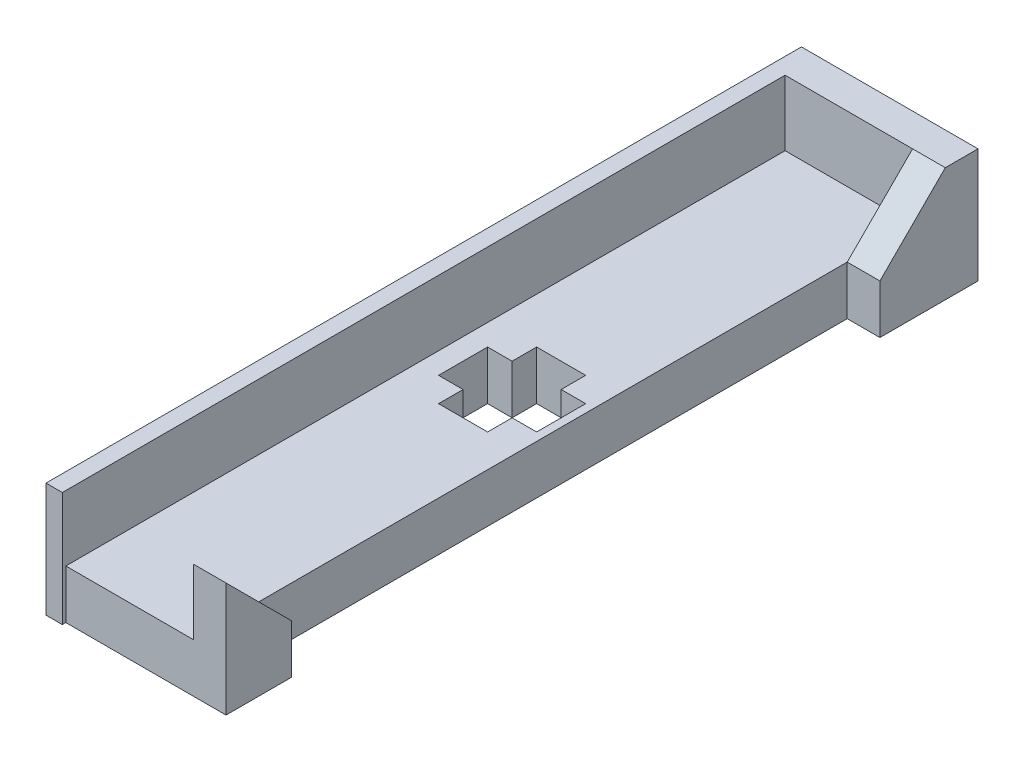
ISO-10303-21;
HEADER;
FILE_DESCRIPTION(('STEP AP214'),'2;1');
FILE_NAME('part.step','',(''),(''),'','','');
FILE_SCHEMA(('AUTOMOTIVE_DESIGN { 1 0 10303 214 1 1 1 1 }'));
ENDSEC;
DATA;
#1=APPLICATION_CONTEXT('core data for automotive mechanical design processes');
#2=APPLICATION_PROTOCOL_DEFINITION('international standard','automotive_design',2000,#1);
#3=PRODUCT_CONTEXT('',#1,'mechanical');
#4=PRODUCT('Part','Part','',(#3));
#5=PRODUCT_RELATED_PRODUCT_CATEGORY('part','',(#4));
#6=PRODUCT_DEFINITION_FORMATION('','',#4);
#7=PRODUCT_DEFINITION_CONTEXT('part definition',#1,'design');
#8=PRODUCT_DEFINITION('design','',#6,#7);
#9=PRODUCT_DEFINITION_SHAPE('','',#8);
#10=(LENGTH_UNIT() NAMED_UNIT(*) SI_UNIT(.MILLI.,.METRE.));
#11=(NAMED_UNIT(*) PLANE_ANGLE_UNIT() SI_UNIT($,.RADIAN.));
#12=(NAMED_UNIT(*) SI_UNIT($,.STERADIAN.) SOLID_ANGLE_UNIT());
#13=UNCERTAINTY_MEASURE_WITH_UNIT(LENGTH_MEASURE(1.E-05),#10,'distance_accuracy_value','');
#14=(GEOMETRIC_REPRESENTATION_CONTEXT(3) GLOBAL_UNCERTAINTY_ASSIGNED_CONTEXT((#13)) GLOBAL_UNIT_ASSIGNED_CONTEXT((#10,
#11,#12)) REPRESENTATION_CONTEXT('',''));
#15=CARTESIAN_POINT('',(0.,0.,0.));
#16=DIRECTION('',(0.,0.,1.));
#17=DIRECTION('',(1.,0.,0.));
#18=AXIS2_PLACEMENT_3D('',#15,#16,#17);
#19=CARTESIAN_POINT('',(-8.71823555429203,3.,-20.));
#20=DIRECTION('',(-1.,0.,0.));
#21=DIRECTION('',(0.,0.,1.));
#22=AXIS2_PLACEMENT_3D('',#19,#20,#21);
#23=PLANE('',#22);
#24=DIRECTION('',(0.,0.,-1.));
#25=VECTOR('',#24,1.);
#26=CARTESIAN_POINT('',(-8.71823555429203,0.,-20.));
#27=LINE('',#26,#25);
#28=CARTESIAN_POINT('',(-8.71823555429203,0.,-20.));
#29=VERTEX_POINT('',#28);
#30=CARTESIAN_POINT('',(-8.71823555429203,0.,-21.5));
#31=VERTEX_POINT('',#30);
#32=EDGE_CURVE('E268',#29,#31,#27,.T.);
#33=ORIENTED_EDGE('',*,*,#32,.T.);
#34=DIRECTION('',(0.,1.,0.));
#35=VECTOR('',#34,1.);
#36=CARTESIAN_POINT('',(-8.71823555429203,3.,-21.5));
#37=LINE('',#36,#35);
#38=CARTESIAN_POINT('',(-8.71823555429203,3.,-21.5));
#39=VERTEX_POINT('',#38);
#40=EDGE_CURVE('E250',#31,#39,#37,.T.);
#41=ORIENTED_EDGE('',*,*,#40,.T.);
#42=DIRECTION('',(0.,0.,-1.));
#43=VECTOR('',#42,1.);
#44=CARTESIAN_POINT('',(-8.71823555429203,3.,-20.));
#45=LINE('',#44,#43);
#46=CARTESIAN_POINT('',(-8.71823555429203,3.,-20.));
#47=VERTEX_POINT('',#46);
#48=EDGE_CURVE('E254',#47,#39,#45,.T.);
#49=ORIENTED_EDGE('',*,*,#48,.F.);
#50=DIRECTION('',(0.,-1.,0.));
#51=VECTOR('',#50,1.);
#52=CARTESIAN_POINT('',(-8.71823555429203,3.,-20.));
#53=LINE('',#52,#51);
#54=EDGE_CURVE('E281',#47,#29,#53,.T.);
#55=ORIENTED_EDGE('',*,*,#54,.T.);
#56=EDGE_LOOP('',(#33,#41,#49,#55));
#57=FACE_BOUND('',#56,.T.);
#58=ADVANCED_FACE('F34',(#57),#23,.F.);
#59=CARTESIAN_POINT('',(-5.71823555429203,3.,-20.));
#60=DIRECTION('',(1.,0.,0.));
#61=DIRECTION('',(0.,0.,-1.));
#62=AXIS2_PLACEMENT_3D('',#59,#60,#61);
#63=PLANE('',#62);
#64=DIRECTION('',(0.,0.,1.));
#65=VECTOR('',#64,1.);
#66=CARTESIAN_POINT('',(-5.71823555429203,3.,-20.));
#67=LINE('',#66,#65);
#68=CARTESIAN_POINT('',(-5.71823555429203,3.,-21.5));
#69=VERTEX_POINT('',#68);
#70=CARTESIAN_POINT('',(-5.71823555429203,3.,-20.));
#71=VERTEX_POINT('',#70);
#72=EDGE_CURVE('E260',#69,#71,#67,.T.);
#73=ORIENTED_EDGE('',*,*,#72,.F.);
#74=DIRECTION('',(0.,-1.,0.));
#75=VECTOR('',#74,1.);
#76=CARTESIAN_POINT('',(-5.71823555429203,3.,-21.5));
#77=LINE('',#76,#75);
#78=CARTESIAN_POINT('',(-5.71823555429203,0.,-21.5));
#79=VERTEX_POINT('',#78);
#80=EDGE_CURVE('E11',#69,#79,#77,.T.);
#81=ORIENTED_EDGE('',*,*,#80,.T.);
#82=DIRECTION('',(0.,0.,1.));
#83=VECTOR('',#82,1.);
#84=CARTESIAN_POINT('',(-5.71823555429203,0.,-20.));
#85=LINE('',#84,#83);
#86=CARTESIAN_POINT('',(-5.71823555429203,0.,-20.));
#87=VERTEX_POINT('',#86);
#88=EDGE_CURVE('E274',#79,#87,#85,.T.);
#89=ORIENTED_EDGE('',*,*,#88,.T.);
#90=DIRECTION('',(0.,-1.,0.));
#91=VECTOR('',#90,1.);
#92=CARTESIAN_POINT('',(-5.71823555429203,3.,-20.));
#93=LINE('',#92,#91);
#94=EDGE_CURVE('E284',#71,#87,#93,.T.);
#95=ORIENTED_EDGE('',*,*,#94,.F.);
#96=EDGE_LOOP('',(#73,#81,#89,#95));
#97=FACE_BOUND('',#96,.T.);
#98=ADVANCED_FACE('F496',(#97),#63,.F.);
#99=CARTESIAN_POINT('',(-3.71823555429203,3.,0.));
#100=DIRECTION('',(-1.,0.,0.));
#101=DIRECTION('',(0.,0.,1.));
#102=AXIS2_PLACEMENT_3D('',#99,#100,#101);
#103=PLANE('',#102);
#104=DIRECTION('',(0.,1.,0.));
#105=VECTOR('',#104,1.);
#106=CARTESIAN_POINT('',(-3.71823555429203,3.,-4.));
#107=LINE('',#106,#105);
#108=CARTESIAN_POINT('',(-3.71823555429203,0.,-4.));
#109=VERTEX_POINT('',#108);
#110=CARTESIAN_POINT('',(-3.71823555429203,3.,-4.));
#111=VERTEX_POINT('',#110);
#112=EDGE_CURVE('E327',#109,#111,#107,.T.);
#113=ORIENTED_EDGE('',*,*,#112,.F.);
#114=DIRECTION('',(0.,0.,-1.));
#115=VECTOR('',#114,1.);
#116=CARTESIAN_POINT('',(-3.71823555429203,0.,0.));
#117=LINE('',#116,#115);
#118=CARTESIAN_POINT('',(-3.71823555429204,0.,-40.));
#119=VERTEX_POINT('',#118);
#120=EDGE_CURVE('E373',#109,#119,#117,.T.);
#121=ORIENTED_EDGE('',*,*,#120,.T.);
#122=DIRECTION('',(0.,-1.,0.));
#123=VECTOR('',#122,1.);
#124=CARTESIAN_POINT('',(-3.71823555429204,3.,-40.));
#125=LINE('',#124,#123);
#126=CARTESIAN_POINT('',(-3.71823555429204,3.,-40.));
#127=VERTEX_POINT('',#126);
#128=EDGE_CURVE('E347',#127,#119,#125,.T.);
#129=ORIENTED_EDGE('',*,*,#128,.F.);
#130=DIRECTION('',(0.,0.,-1.));
#131=VECTOR('',#130,1.);
#132=CARTESIAN_POINT('',(-3.71823555429203,3.,0.));
#133=LINE('',#132,#131);
#134=EDGE_CURVE('E378',#111,#127,#133,.T.);
#135=ORIENTED_EDGE('',*,*,#134,.F.);
#136=EDGE_LOOP('',(#113,#121,#129,#135));
#137=FACE_BOUND('',#136,.T.);
#138=ADVANCED_FACE('F504',(#137),#103,.F.);
#139=CARTESIAN_POINT('',(-11.518235554292,3.,0.));
#140=DIRECTION('',(0.,0.,-1.));
#141=DIRECTION('',(-1.,0.,0.));
#142=AXIS2_PLACEMENT_3D('',#139,#140,#141);
#143=PLANE('',#142);
#144=DIRECTION('',(1.,0.,0.));
#145=VECTOR('',#144,1.);
#146=CARTESIAN_POINT('',(-11.518235554292,0.,0.));
#147=LINE('',#146,#145);
#148=CARTESIAN_POINT('',(-11.518235554292,0.,0.));
#149=VERTEX_POINT('',#148);
#150=CARTESIAN_POINT('',(-1.71823555429203,0.,0.));
#151=VERTEX_POINT('',#150);
#152=EDGE_CURVE('E377',#149,#151,#147,.T.);
#153=ORIENTED_EDGE('',*,*,#152,.T.);
#154=DIRECTION('',(0.,-1.,0.));
#155=VECTOR('',#154,1.);
#156=CARTESIAN_POINT('',(-1.71823555429203,0.,0.));
#157=LINE('',#156,#155);
#158=CARTESIAN_POINT('',(-1.71823555429203,7.,0.));
#159=VERTEX_POINT('',#158);
#160=EDGE_CURVE('E323',#159,#151,#157,.T.);
#161=ORIENTED_EDGE('',*,*,#160,.F.);
#162=DIRECTION('',(-1.,0.,0.));
#163=VECTOR('',#162,1.);
#164=CARTESIAN_POINT('',(-1.71823555429203,7.,0.));
#165=LINE('',#164,#163);
#166=CARTESIAN_POINT('',(-3.71823555429203,7.,0.));
#167=VERTEX_POINT('',#166);
#168=EDGE_CURVE('E326',#159,#167,#165,.T.);
#169=ORIENTED_EDGE('',*,*,#168,.T.);
#170=DIRECTION('',(0.,-1.,0.));
#171=VECTOR('',#170,1.);
#172=CARTESIAN_POINT('',(-3.71823555429203,0.,0.));
#173=LINE('',#172,#171);
#174=CARTESIAN_POINT('',(-3.71823555429203,3.,0.));
#175=VERTEX_POINT('',#174);
#176=EDGE_CURVE('E319',#167,#175,#173,.T.);
#177=ORIENTED_EDGE('',*,*,#176,.T.);
#178=DIRECTION('',(1.,0.,0.));
#179=VECTOR('',#178,1.);
#180=CARTESIAN_POINT('',(-11.518235554292,3.,0.));
#181=LINE('',#180,#179);
#182=CARTESIAN_POINT('',(-11.518235554292,3.,0.));
#183=VERTEX_POINT('',#182);
#184=EDGE_CURVE('E392',#183,#175,#181,.T.);
#185=ORIENTED_EDGE('',*,*,#184,.F.);
#186=DIRECTION('',(0.,-1.,0.));
#187=VECTOR('',#186,1.);
#188=CARTESIAN_POINT('',(-11.518235554292,3.,0.));
#189=LINE('',#188,#187);
#190=EDGE_CURVE('E388',#183,#149,#189,.T.);
#191=ORIENTED_EDGE('',*,*,#190,.T.);
#192=EDGE_LOOP('',(#153,#161,#169,#177,#185,#191));
#193=FACE_BOUND('',#192,.T.);
#194=ADVANCED_FACE('F36',(#193),#143,.F.);
#195=CARTESIAN_POINT('',(0.,3.,0.));
#196=DIRECTION('',(0.,-1.,0.));
#197=DIRECTION('',(0.,0.,-1.));
#198=AXIS2_PLACEMENT_3D('',#195,#196,#197);
#199=PLANE('',#198);
#200=ORIENTED_EDGE('',*,*,#48,.T.);
#201=DIRECTION('',(-1.,0.,0.));
#202=VECTOR('',#201,1.);
#203=CARTESIAN_POINT('',(-10.218235554292,3.,-21.5));
#204=LINE('',#203,#202);
#205=CARTESIAN_POINT('',(-10.218235554292,3.,-21.5));
#206=VERTEX_POINT('',#205);
#207=EDGE_CURVE('E227',#39,#206,#204,.T.);
#208=ORIENTED_EDGE('',*,*,#207,.T.);
#209=DIRECTION('',(0.,0.,-1.));
#210=VECTOR('',#209,1.);
#211=CARTESIAN_POINT('',(-10.218235554292,3.,-21.5));
#212=LINE('',#211,#210);
#213=CARTESIAN_POINT('',(-10.218235554292,3.,-24.5));
#214=VERTEX_POINT('',#213);
#215=EDGE_CURVE('E209',#206,#214,#212,.T.);
#216=ORIENTED_EDGE('',*,*,#215,.T.);
#217=DIRECTION('',(1.,0.,0.));
#218=VECTOR('',#217,1.);
#219=CARTESIAN_POINT('',(-10.218235554292,3.,-24.5));
#220=LINE('',#219,#218);
#221=CARTESIAN_POINT('',(-8.71823555429203,3.,-24.5));
#222=VERTEX_POINT('',#221);
#223=EDGE_CURVE('E217',#214,#222,#220,.T.);
#224=ORIENTED_EDGE('',*,*,#223,.T.);
#225=CARTESIAN_POINT('',(-8.71823555429203,3.,-26.));
#226=VERTEX_POINT('',#225);
#227=EDGE_CURVE('E257',#222,#226,#45,.T.);
#228=ORIENTED_EDGE('',*,*,#227,.T.);
#229=DIRECTION('',(1.,0.,0.));
#230=VECTOR('',#229,1.);
#231=CARTESIAN_POINT('',(-8.71823555429203,3.,-26.));
#232=LINE('',#231,#230);
#233=CARTESIAN_POINT('',(-5.71823555429203,3.,-26.));
#234=VERTEX_POINT('',#233);
#235=EDGE_CURVE('E256',#226,#234,#232,.T.);
#236=ORIENTED_EDGE('',*,*,#235,.T.);
#237=CARTESIAN_POINT('',(-5.71823555429203,3.,-24.5));
#238=VERTEX_POINT('',#237);
#239=EDGE_CURVE('E261',#234,#238,#67,.T.);
#240=ORIENTED_EDGE('',*,*,#239,.T.);
#241=CARTESIAN_POINT('',(-4.21823555429203,3.,-24.5));
#242=VERTEX_POINT('',#241);
#243=EDGE_CURVE('E57',#238,#242,#220,.T.);
#244=ORIENTED_EDGE('',*,*,#243,.T.);
#245=DIRECTION('',(0.,0.,1.));
#246=VECTOR('',#245,1.);
#247=CARTESIAN_POINT('',(-4.21823555429203,3.,-21.5));
#248=LINE('',#247,#246);
#249=CARTESIAN_POINT('',(-4.21823555429203,3.,-21.5));
#250=VERTEX_POINT('',#249);
#251=EDGE_CURVE('E222',#242,#250,#248,.T.);
#252=ORIENTED_EDGE('',*,*,#251,.T.);
#253=EDGE_CURVE('E214',#250,#69,#204,.T.);
#254=ORIENTED_EDGE('',*,*,#253,.T.);
#255=ORIENTED_EDGE('',*,*,#72,.T.);
#256=DIRECTION('',(-1.,0.,0.));
#257=VECTOR('',#256,1.);
#258=CARTESIAN_POINT('',(-8.71823555429203,3.,-20.));
#259=LINE('',#258,#257);
#260=EDGE_CURVE('E264',#71,#47,#259,.T.);
#261=ORIENTED_EDGE('',*,*,#260,.T.);
#262=EDGE_LOOP('',(#200,#208,#216,#224,#228,#236,#240,#244,#252,#254,#255,#261));
#263=FACE_BOUND('',#262,.T.);
#264=DIRECTION('',(0.,0.,1.));
#265=VECTOR('',#264,1.);
#266=CARTESIAN_POINT('',(-11.518235554292,3.,0.));
#267=LINE('',#266,#265);
#268=CARTESIAN_POINT('',(-11.518235554292,3.,-44.));
#269=VERTEX_POINT('',#268);
#270=EDGE_CURVE('E376',#269,#183,#267,.T.);
#271=ORIENTED_EDGE('',*,*,#270,.T.);
#272=ORIENTED_EDGE('',*,*,#184,.T.);
#273=EDGE_CURVE('E389',#175,#111,#133,.T.);
#274=ORIENTED_EDGE('',*,*,#273,.T.);
#275=ORIENTED_EDGE('',*,*,#134,.T.);
#276=CARTESIAN_POINT('',(-3.71823555429204,3.,-44.));
#277=VERTEX_POINT('',#276);
#278=EDGE_CURVE('E367',#127,#277,#133,.T.);
#279=ORIENTED_EDGE('',*,*,#278,.T.);
#280=DIRECTION('',(-1.,0.,0.));
#281=VECTOR('',#280,1.);
#282=CARTESIAN_POINT('',(-11.518235554292,3.,-44.));
#283=LINE('',#282,#281);
#284=EDGE_CURVE('E385',#277,#269,#283,.T.);
#285=ORIENTED_EDGE('',*,*,#284,.T.);
#286=EDGE_LOOP('',(#271,#272,#274,#275,#279,#285));
#287=FACE_BOUND('',#286,.T.);
#288=ADVANCED_FACE('F225',(#263,#287),#199,.F.);
#289=CARTESIAN_POINT('',(0.,0.,0.));
#290=DIRECTION('',(0.,-1.,0.));
#291=DIRECTION('',(0.,0.,-1.));
#292=AXIS2_PLACEMENT_3D('',#289,#290,#291);
#293=PLANE('',#292);
#294=DIRECTION('',(-1.,0.,0.));
#295=VECTOR('',#294,1.);
#296=CARTESIAN_POINT('',(-10.218235554292,0.,-21.5));
#297=LINE('',#296,#295);
#298=CARTESIAN_POINT('',(-10.218235554292,0.,-21.5));
#299=VERTEX_POINT('',#298);
#300=EDGE_CURVE('E230',#31,#299,#297,.T.);
#301=ORIENTED_EDGE('',*,*,#300,.F.);
#302=ORIENTED_EDGE('',*,*,#32,.F.);
#303=DIRECTION('',(-1.,0.,0.));
#304=VECTOR('',#303,1.);
#305=CARTESIAN_POINT('',(-8.71823555429203,0.,-20.));
#306=LINE('',#305,#304);
#307=EDGE_CURVE('E278',#87,#29,#306,.T.);
#308=ORIENTED_EDGE('',*,*,#307,.F.);
#309=ORIENTED_EDGE('',*,*,#88,.F.);
#310=CARTESIAN_POINT('',(-4.21823555429203,0.,-21.5));
#311=VERTEX_POINT('',#310);
#312=EDGE_CURVE('E228',#311,#79,#297,.T.);
#313=ORIENTED_EDGE('',*,*,#312,.F.);
#314=DIRECTION('',(0.,0.,1.));
#315=VECTOR('',#314,1.);
#316=CARTESIAN_POINT('',(-4.21823555429203,0.,-21.5));
#317=LINE('',#316,#315);
#318=CARTESIAN_POINT('',(-4.21823555429203,0.,-24.5));
#319=VERTEX_POINT('',#318);
#320=EDGE_CURVE('E240',#319,#311,#317,.T.);
#321=ORIENTED_EDGE('',*,*,#320,.F.);
#322=DIRECTION('',(1.,0.,0.));
#323=VECTOR('',#322,1.);
#324=CARTESIAN_POINT('',(-10.218235554292,0.,-24.5));
#325=LINE('',#324,#323);
#326=CARTESIAN_POINT('',(-5.71823555429203,0.,-24.5));
#327=VERTEX_POINT('',#326);
#328=EDGE_CURVE('E238',#327,#319,#325,.T.);
#329=ORIENTED_EDGE('',*,*,#328,.F.);
#330=CARTESIAN_POINT('',(-5.71823555429203,0.,-26.));
#331=VERTEX_POINT('',#330);
#332=EDGE_CURVE('E275',#331,#327,#85,.T.);
#333=ORIENTED_EDGE('',*,*,#332,.F.);
#334=DIRECTION('',(1.,0.,0.));
#335=VECTOR('',#334,1.);
#336=CARTESIAN_POINT('',(-8.71823555429203,0.,-26.));
#337=LINE('',#336,#335);
#338=CARTESIAN_POINT('',(-8.71823555429203,0.,-26.));
#339=VERTEX_POINT('',#338);
#340=EDGE_CURVE('E271',#339,#331,#337,.T.);
#341=ORIENTED_EDGE('',*,*,#340,.F.);
#342=CARTESIAN_POINT('',(-8.71823555429203,0.,-24.5));
#343=VERTEX_POINT('',#342);
#344=EDGE_CURVE('E253',#343,#339,#27,.T.);
#345=ORIENTED_EDGE('',*,*,#344,.F.);
#346=CARTESIAN_POINT('',(-10.218235554292,0.,-24.5));
#347=VERTEX_POINT('',#346);
#348=EDGE_CURVE('E49',#347,#343,#325,.T.);
#349=ORIENTED_EDGE('',*,*,#348,.F.);
#350=DIRECTION('',(0.,0.,-1.));
#351=VECTOR('',#350,1.);
#352=CARTESIAN_POINT('',(-10.218235554292,0.,-21.5));
#353=LINE('',#352,#351);
#354=EDGE_CURVE('E212',#299,#347,#353,.T.);
#355=ORIENTED_EDGE('',*,*,#354,.F.);
#356=EDGE_LOOP('',(#301,#302,#308,#309,#313,#321,#329,#333,#341,#345,#349,#355));
#357=FACE_BOUND('',#356,.T.);
#358=ORIENTED_EDGE('',*,*,#152,.F.);
#359=DIRECTION('',(0.,0.,1.));
#360=VECTOR('',#359,1.);
#361=CARTESIAN_POINT('',(-11.518235554292,0.,-46.));
#362=LINE('',#361,#360);
#363=CARTESIAN_POINT('',(-11.518235554292,0.,0.213242819228467));
#364=VERTEX_POINT('',#363);
#365=EDGE_CURVE('E311',#149,#364,#362,.T.);
#366=ORIENTED_EDGE('',*,*,#365,.T.);
#367=DIRECTION('',(1.,0.,0.));
#368=VECTOR('',#367,1.);
#369=CARTESIAN_POINT('',(-12.518235554292,0.,0.213242819228468));
#370=LINE('',#369,#368);
#371=CARTESIAN_POINT('',(-12.518235554292,0.,0.213242819228468));
#372=VERTEX_POINT('',#371);
#373=EDGE_CURVE('E312',#372,#364,#370,.T.);
#374=ORIENTED_EDGE('',*,*,#373,.F.);
#375=DIRECTION('',(0.,0.,1.));
#376=VECTOR('',#375,1.);
#377=CARTESIAN_POINT('',(-12.518235554292,0.,-46.));
#378=LINE('',#377,#376);
#379=CARTESIAN_POINT('',(-12.518235554292,0.,-46.));
#380=VERTEX_POINT('',#379);
#381=EDGE_CURVE('E298',#380,#372,#378,.T.);
#382=ORIENTED_EDGE('',*,*,#381,.F.);
#383=DIRECTION('',(-1.,0.,0.));
#384=VECTOR('',#383,1.);
#385=CARTESIAN_POINT('',(-3.71823555429204,0.,-46.));
#386=LINE('',#385,#384);
#387=CARTESIAN_POINT('',(-1.71823555429204,0.,-46.));
#388=VERTEX_POINT('',#387);
#389=EDGE_CURVE('E416',#388,#380,#386,.T.);
#390=ORIENTED_EDGE('',*,*,#389,.F.);
#391=DIRECTION('',(0.,0.,-1.));
#392=VECTOR('',#391,1.);
#393=CARTESIAN_POINT('',(-1.71823555429204,0.,-40.));
#394=LINE('',#393,#392);
#395=CARTESIAN_POINT('',(-1.71823555429204,0.,-40.));
#396=VERTEX_POINT('',#395);
#397=EDGE_CURVE('E353',#396,#388,#394,.T.);
#398=ORIENTED_EDGE('',*,*,#397,.F.);
#399=DIRECTION('',(-1.,0.,0.));
#400=VECTOR('',#399,1.);
#401=CARTESIAN_POINT('',(-1.71823555429204,0.,-40.));
#402=LINE('',#401,#400);
#403=EDGE_CURVE('E356',#396,#119,#402,.T.);
#404=ORIENTED_EDGE('',*,*,#403,.T.);
#405=ORIENTED_EDGE('',*,*,#120,.F.);
#406=DIRECTION('',(-1.,0.,0.));
#407=VECTOR('',#406,1.);
#408=CARTESIAN_POINT('',(-1.71823555429203,0.,-4.));
#409=LINE('',#408,#407);
#410=CARTESIAN_POINT('',(-1.71823555429203,0.,-4.));
#411=VERTEX_POINT('',#410);
#412=EDGE_CURVE('E339',#411,#109,#409,.T.);
#413=ORIENTED_EDGE('',*,*,#412,.F.);
#414=DIRECTION('',(0.,0.,-1.));
#415=VECTOR('',#414,1.);
#416=CARTESIAN_POINT('',(-1.71823555429203,0.,-4.));
#417=LINE('',#416,#415);
#418=EDGE_CURVE('E315',#151,#411,#417,.T.);
#419=ORIENTED_EDGE('',*,*,#418,.F.);
#420=EDGE_LOOP('',(#358,#366,#374,#382,#390,#398,#404,#405,#413,#419));
#421=FACE_BOUND('',#420,.T.);
#422=ADVANCED_FACE('F466',(#357,#421),#293,.T.);
#423=CARTESIAN_POINT('',(0.,0.,-44.));
#424=DIRECTION('',(0.,0.,1.));
#425=DIRECTION('',(1.,0.,0.));
#426=AXIS2_PLACEMENT_3D('',#423,#424,#425);
#427=PLANE('',#426);
#428=ORIENTED_EDGE('',*,*,#284,.F.);
#429=DIRECTION('',(0.,-1.,0.));
#430=VECTOR('',#429,1.);
#431=CARTESIAN_POINT('',(-3.71823555429204,0.,-44.));
#432=LINE('',#431,#430);
#433=CARTESIAN_POINT('',(-3.71823555429204,7.,-44.));
#434=VERTEX_POINT('',#433);
#435=EDGE_CURVE('E409',#434,#277,#432,.T.);
#436=ORIENTED_EDGE('',*,*,#435,.F.);
#437=DIRECTION('',(1.,0.,0.));
#438=VECTOR('',#437,1.);
#439=CARTESIAN_POINT('',(-3.71823555429204,7.,-44.));
#440=LINE('',#439,#438);
#441=CARTESIAN_POINT('',(-11.518235554292,7.,-44.));
#442=VERTEX_POINT('',#441);
#443=EDGE_CURVE('E408',#442,#434,#440,.T.);
#444=ORIENTED_EDGE('',*,*,#443,.F.);
#445=DIRECTION('',(0.,1.,0.));
#446=VECTOR('',#445,1.);
#447=CARTESIAN_POINT('',(-11.518235554292,0.,-44.));
#448=LINE('',#447,#446);
#449=EDGE_CURVE('E404',#269,#442,#448,.T.);
#450=ORIENTED_EDGE('',*,*,#449,.F.);
#451=EDGE_LOOP('',(#428,#436,#444,#450));
#452=FACE_BOUND('',#451,.T.);
#453=ADVANCED_FACE('F435',(#452),#427,.T.);
#454=CARTESIAN_POINT('',(-3.71823555429204,7.,-46.));
#455=DIRECTION('',(0.,-1.,0.));
#456=DIRECTION('',(0.,0.,-1.));
#457=AXIS2_PLACEMENT_3D('',#454,#455,#456);
#458=PLANE('',#457);
#459=ORIENTED_EDGE('',*,*,#443,.T.);
#460=DIRECTION('',(-1.,0.,0.));
#461=VECTOR('',#460,1.);
#462=CARTESIAN_POINT('',(-1.71823555429204,7.,-44.));
#463=LINE('',#462,#461);
#464=CARTESIAN_POINT('',(-1.71823555429204,7.,-44.));
#465=VERTEX_POINT('',#464);
#466=EDGE_CURVE('E417',#465,#434,#463,.T.);
#467=ORIENTED_EDGE('',*,*,#466,.F.);
#468=DIRECTION('',(0.,0.,1.));
#469=VECTOR('',#468,1.);
#470=CARTESIAN_POINT('',(-1.71823555429204,7.,-46.));
#471=LINE('',#470,#469);
#472=CARTESIAN_POINT('',(-1.71823555429204,7.,-46.));
#473=VERTEX_POINT('',#472);
#474=EDGE_CURVE('E346',#473,#465,#471,.T.);
#475=ORIENTED_EDGE('',*,*,#474,.F.);
#476=DIRECTION('',(1.,0.,0.));
#477=VECTOR('',#476,1.);
#478=CARTESIAN_POINT('',(-3.71823555429204,7.,-46.));
#479=LINE('',#478,#477);
#480=CARTESIAN_POINT('',(-12.518235554292,7.,-46.));
#481=VERTEX_POINT('',#480);
#482=EDGE_CURVE('E414',#481,#473,#479,.T.);
#483=ORIENTED_EDGE('',*,*,#482,.F.);
#484=DIRECTION('',(0.,0.,-1.));
#485=VECTOR('',#484,1.);
#486=CARTESIAN_POINT('',(-12.518235554292,7.,-46.));
#487=LINE('',#486,#485);
#488=CARTESIAN_POINT('',(-12.518235554292,7.,0.213242819228468));
#489=VERTEX_POINT('',#488);
#490=EDGE_CURVE('E291',#489,#481,#487,.T.);
#491=ORIENTED_EDGE('',*,*,#490,.F.);
#492=DIRECTION('',(1.,0.,0.));
#493=VECTOR('',#492,1.);
#494=CARTESIAN_POINT('',(-12.518235554292,7.,0.213242819228468));
#495=LINE('',#494,#493);
#496=CARTESIAN_POINT('',(-11.518235554292,7.,0.213242819228467));
#497=VERTEX_POINT('',#496);
#498=EDGE_CURVE('E302',#489,#497,#495,.T.);
#499=ORIENTED_EDGE('',*,*,#498,.T.);
#500=DIRECTION('',(0.,0.,-1.));
#501=VECTOR('',#500,1.);
#502=CARTESIAN_POINT('',(-11.518235554292,7.,-46.));
#503=LINE('',#502,#501);
#504=EDGE_CURVE('E283',#497,#442,#503,.T.);
#505=ORIENTED_EDGE('',*,*,#504,.T.);
#506=EDGE_LOOP('',(#459,#467,#475,#483,#491,#499,#505));
#507=FACE_BOUND('',#506,.T.);
#508=ADVANCED_FACE('F454',(#507),#458,.F.);
#509=CARTESIAN_POINT('',(0.,0.,-46.));
#510=DIRECTION('',(0.,0.,1.));
#511=DIRECTION('',(1.,0.,0.));
#512=AXIS2_PLACEMENT_3D('',#509,#510,#511);
#513=PLANE('',#512);
#514=ORIENTED_EDGE('',*,*,#482,.T.);
#515=DIRECTION('',(0.,1.,0.));
#516=VECTOR('',#515,1.);
#517=CARTESIAN_POINT('',(-1.71823555429204,0.,-46.));
#518=LINE('',#517,#516);
#519=EDGE_CURVE('E343',#388,#473,#518,.T.);
#520=ORIENTED_EDGE('',*,*,#519,.F.);
#521=ORIENTED_EDGE('',*,*,#389,.T.);
#522=DIRECTION('',(0.,-1.,0.));
#523=VECTOR('',#522,1.);
#524=CARTESIAN_POINT('',(-12.518235554292,7.,-46.));
#525=LINE('',#524,#523);
#526=EDGE_CURVE('E294',#481,#380,#525,.T.);
#527=ORIENTED_EDGE('',*,*,#526,.F.);
#528=EDGE_LOOP('',(#514,#520,#521,#527));
#529=FACE_BOUND('',#528,.T.);
#530=ADVANCED_FACE('F667',(#529),#513,.F.);
#531=CARTESIAN_POINT('',(-3.71823555429203,0.,0.));
#532=DIRECTION('',(1.,0.,0.));
#533=DIRECTION('',(0.,0.,-1.));
#534=AXIS2_PLACEMENT_3D('',#531,#532,#533);
#535=PLANE('',#534);
#536=DIRECTION('',(0.,-0.707106781186547,0.707106781186548));
#537=VECTOR('',#536,1.);
#538=CARTESIAN_POINT('',(-3.71823555429204,7.,-44.));
#539=LINE('',#538,#537);
#540=EDGE_CURVE('E342',#434,#127,#539,.T.);
#541=ORIENTED_EDGE('',*,*,#540,.F.);
#542=ORIENTED_EDGE('',*,*,#435,.T.);
#543=ORIENTED_EDGE('',*,*,#278,.F.);
#544=EDGE_LOOP('',(#541,#542,#543));
#545=FACE_BOUND('',#544,.T.);
#546=ADVANCED_FACE('F432',(#545),#535,.F.);
#547=CARTESIAN_POINT('',(-1.71823555429204,7.,-44.));
#548=DIRECTION('',(0.,-0.707106781186548,-0.707106781186547));
#549=DIRECTION('',(0.,0.707106781186547,-0.707106781186548));
#550=AXIS2_PLACEMENT_3D('',#547,#548,#549);
#551=PLANE('',#550);
#552=ORIENTED_EDGE('',*,*,#540,.T.);
#553=DIRECTION('',(-1.,0.,0.));
#554=VECTOR('',#553,1.);
#555=CARTESIAN_POINT('',(-1.71823555429204,3.,-40.));
#556=LINE('',#555,#554);
#557=CARTESIAN_POINT('',(-1.71823555429204,3.,-40.));
#558=VERTEX_POINT('',#557);
#559=EDGE_CURVE('E361',#558,#127,#556,.T.);
#560=ORIENTED_EDGE('',*,*,#559,.F.);
#561=DIRECTION('',(0.,-0.707106781186547,0.707106781186548));
#562=VECTOR('',#561,1.);
#563=CARTESIAN_POINT('',(-1.71823555429204,7.,-44.));
#564=LINE('',#563,#562);
#565=EDGE_CURVE('E349',#465,#558,#564,.T.);
#566=ORIENTED_EDGE('',*,*,#565,.F.);
#567=ORIENTED_EDGE('',*,*,#466,.T.);
#568=EDGE_LOOP('',(#552,#560,#566,#567));
#569=FACE_BOUND('',#568,.T.);
#570=ADVANCED_FACE('F430',(#569),#551,.F.);
#571=CARTESIAN_POINT('',(-1.71823555429204,3.,-40.));
#572=DIRECTION('',(0.,0.,-1.));
#573=DIRECTION('',(-1.,0.,0.));
#574=AXIS2_PLACEMENT_3D('',#571,#572,#573);
#575=PLANE('',#574);
#576=ORIENTED_EDGE('',*,*,#128,.T.);
#577=ORIENTED_EDGE('',*,*,#403,.F.);
#578=DIRECTION('',(0.,-1.,0.));
#579=VECTOR('',#578,1.);
#580=CARTESIAN_POINT('',(-1.71823555429204,3.,-40.));
#581=LINE('',#580,#579);
#582=EDGE_CURVE('E351',#558,#396,#581,.T.);
#583=ORIENTED_EDGE('',*,*,#582,.F.);
#584=ORIENTED_EDGE('',*,*,#559,.T.);
#585=EDGE_LOOP('',(#576,#577,#583,#584));
#586=FACE_BOUND('',#585,.T.);
#587=ADVANCED_FACE('F428',(#586),#575,.F.);
#588=CARTESIAN_POINT('',(-1.71823555429203,0.,0.));
#589=DIRECTION('',(1.,0.,0.));
#590=DIRECTION('',(0.,0.,-1.));
#591=AXIS2_PLACEMENT_3D('',#588,#589,#590);
#592=PLANE('',#591);
#593=ORIENTED_EDGE('',*,*,#519,.T.);
#594=ORIENTED_EDGE('',*,*,#474,.T.);
#595=ORIENTED_EDGE('',*,*,#565,.T.);
#596=ORIENTED_EDGE('',*,*,#582,.T.);
#597=ORIENTED_EDGE('',*,*,#397,.T.);
#598=EDGE_LOOP('',(#593,#594,#595,#596,#597));
#599=FACE_BOUND('',#598,.T.);
#600=ADVANCED_FACE('F483',(#599),#592,.T.);
#601=CARTESIAN_POINT('',(-3.71823555429203,0.,0.));
#602=DIRECTION('',(-1.,0.,0.));
#603=DIRECTION('',(0.,0.,1.));
#604=AXIS2_PLACEMENT_3D('',#601,#602,#603);
#605=PLANE('',#604);
#606=ORIENTED_EDGE('',*,*,#273,.F.);
#607=ORIENTED_EDGE('',*,*,#176,.F.);
#608=DIRECTION('',(0.,0.707106781186547,0.707106781186548));
#609=VECTOR('',#608,1.);
#610=CARTESIAN_POINT('',(-3.71823555429203,7.,0.));
#611=LINE('',#610,#609);
#612=EDGE_CURVE('E330',#111,#167,#611,.T.);
#613=ORIENTED_EDGE('',*,*,#612,.F.);
#614=EDGE_LOOP('',(#606,#607,#613));
#615=FACE_BOUND('',#614,.T.);
#616=ADVANCED_FACE('F480',(#615),#605,.T.);
#617=CARTESIAN_POINT('',(-1.71823555429203,3.,-4.));
#618=DIRECTION('',(0.,0.,1.));
#619=DIRECTION('',(1.,0.,0.));
#620=AXIS2_PLACEMENT_3D('',#617,#618,#619);
#621=PLANE('',#620);
#622=ORIENTED_EDGE('',*,*,#112,.T.);
#623=DIRECTION('',(-1.,0.,0.));
#624=VECTOR('',#623,1.);
#625=CARTESIAN_POINT('',(-1.71823555429203,3.,-4.));
#626=LINE('',#625,#624);
#627=CARTESIAN_POINT('',(-1.71823555429203,3.,-4.));
#628=VERTEX_POINT('',#627);
#629=EDGE_CURVE('E336',#628,#111,#626,.T.);
#630=ORIENTED_EDGE('',*,*,#629,.F.);
#631=DIRECTION('',(0.,1.,0.));
#632=VECTOR('',#631,1.);
#633=CARTESIAN_POINT('',(-1.71823555429203,3.,-4.));
#634=LINE('',#633,#632);
#635=EDGE_CURVE('E318',#411,#628,#634,.T.);
#636=ORIENTED_EDGE('',*,*,#635,.F.);
#637=ORIENTED_EDGE('',*,*,#412,.T.);
#638=EDGE_LOOP('',(#622,#630,#636,#637));
#639=FACE_BOUND('',#638,.T.);
#640=ADVANCED_FACE('F482',(#639),#621,.F.);
#641=CARTESIAN_POINT('',(-1.71823555429203,7.,0.));
#642=DIRECTION('',(0.,-0.707106781186548,0.707106781186547));
#643=DIRECTION('',(0.,-0.707106781186547,-0.707106781186548));
#644=AXIS2_PLACEMENT_3D('',#641,#642,#643);
#645=PLANE('',#644);
#646=ORIENTED_EDGE('',*,*,#612,.T.);
#647=ORIENTED_EDGE('',*,*,#168,.F.);
#648=DIRECTION('',(0.,0.707106781186547,0.707106781186548));
#649=VECTOR('',#648,1.);
#650=CARTESIAN_POINT('',(-1.71823555429203,7.,0.));
#651=LINE('',#650,#649);
#652=EDGE_CURVE('E321',#628,#159,#651,.T.);
#653=ORIENTED_EDGE('',*,*,#652,.F.);
#654=ORIENTED_EDGE('',*,*,#629,.T.);
#655=EDGE_LOOP('',(#646,#647,#653,#654));
#656=FACE_BOUND('',#655,.T.);
#657=ADVANCED_FACE('F476',(#656),#645,.F.);
#658=CARTESIAN_POINT('',(-1.71823555429203,0.,0.));
#659=DIRECTION('',(-1.,0.,0.));
#660=DIRECTION('',(0.,0.,1.));
#661=AXIS2_PLACEMENT_3D('',#658,#659,#660);
#662=PLANE('',#661);
#663=ORIENTED_EDGE('',*,*,#418,.T.);
#664=ORIENTED_EDGE('',*,*,#635,.T.);
#665=ORIENTED_EDGE('',*,*,#652,.T.);
#666=ORIENTED_EDGE('',*,*,#160,.T.);
#667=EDGE_LOOP('',(#663,#664,#665,#666));
#668=FACE_BOUND('',#667,.T.);
#669=ADVANCED_FACE('F471',(#668),#662,.F.);
#670=CARTESIAN_POINT('',(-11.518235554292,0.,0.));
#671=DIRECTION('',(1.,0.,0.));
#672=DIRECTION('',(0.,0.,-1.));
#673=AXIS2_PLACEMENT_3D('',#670,#671,#672);
#674=PLANE('',#673);
#675=ORIENTED_EDGE('',*,*,#190,.F.);
#676=ORIENTED_EDGE('',*,*,#270,.F.);
#677=ORIENTED_EDGE('',*,*,#449,.T.);
#678=ORIENTED_EDGE('',*,*,#504,.F.);
#679=DIRECTION('',(0.,1.,0.));
#680=VECTOR('',#679,1.);
#681=CARTESIAN_POINT('',(-11.518235554292,7.,0.213242819228467));
#682=LINE('',#681,#680);
#683=EDGE_CURVE('E295',#364,#497,#682,.T.);
#684=ORIENTED_EDGE('',*,*,#683,.F.);
#685=ORIENTED_EDGE('',*,*,#365,.F.);
#686=EDGE_LOOP('',(#675,#676,#677,#678,#684,#685));
#687=FACE_BOUND('',#686,.T.);
#688=ADVANCED_FACE('F439',(#687),#674,.T.);
#689=CARTESIAN_POINT('',(-12.518235554292,7.,0.213242819228468));
#690=DIRECTION('',(0.,0.,-1.));
#691=DIRECTION('',(-1.,0.,0.));
#692=AXIS2_PLACEMENT_3D('',#689,#690,#691);
#693=PLANE('',#692);
#694=ORIENTED_EDGE('',*,*,#683,.T.);
#695=ORIENTED_EDGE('',*,*,#498,.F.);
#696=DIRECTION('',(0.,1.,0.));
#697=VECTOR('',#696,1.);
#698=CARTESIAN_POINT('',(-12.518235554292,7.,0.213242819228468));
#699=LINE('',#698,#697);
#700=EDGE_CURVE('E300',#372,#489,#699,.T.);
#701=ORIENTED_EDGE('',*,*,#700,.F.);
#702=ORIENTED_EDGE('',*,*,#373,.T.);
#703=EDGE_LOOP('',(#694,#695,#701,#702));
#704=FACE_BOUND('',#703,.T.);
#705=ADVANCED_FACE('F463',(#704),#693,.F.);
#706=CARTESIAN_POINT('',(-12.518235554292,0.,0.));
#707=DIRECTION('',(1.,0.,0.));
#708=DIRECTION('',(0.,0.,-1.));
#709=AXIS2_PLACEMENT_3D('',#706,#707,#708);
#710=PLANE('',#709);
#711=ORIENTED_EDGE('',*,*,#490,.T.);
#712=ORIENTED_EDGE('',*,*,#526,.T.);
#713=ORIENTED_EDGE('',*,*,#381,.T.);
#714=ORIENTED_EDGE('',*,*,#700,.T.);
#715=EDGE_LOOP('',(#711,#712,#713,#714));
#716=FACE_BOUND('',#715,.T.);
#717=ADVANCED_FACE('F512',(#716),#710,.F.);
#718=ORIENTED_EDGE('',*,*,#227,.F.);
#719=DIRECTION('',(0.,-1.,0.));
#720=VECTOR('',#719,1.);
#721=CARTESIAN_POINT('',(-8.71823555429203,3.,-24.5));
#722=LINE('',#721,#720);
#723=EDGE_CURVE('E219',#222,#343,#722,.T.);
#724=ORIENTED_EDGE('',*,*,#723,.T.);
#725=ORIENTED_EDGE('',*,*,#344,.T.);
#726=DIRECTION('',(0.,-1.,0.));
#727=VECTOR('',#726,1.);
#728=CARTESIAN_POINT('',(-8.71823555429203,3.,-26.));
#729=LINE('',#728,#727);
#730=EDGE_CURVE('E267',#226,#339,#729,.T.);
#731=ORIENTED_EDGE('',*,*,#730,.F.);
#732=EDGE_LOOP('',(#718,#724,#725,#731));
#733=FACE_BOUND('',#732,.T.);
#734=ADVANCED_FACE('F499',(#733),#23,.F.);
#735=CARTESIAN_POINT('',(-8.71823555429203,3.,-20.));
#736=DIRECTION('',(0.,0.,1.));
#737=DIRECTION('',(1.,0.,0.));
#738=AXIS2_PLACEMENT_3D('',#735,#736,#737);
#739=PLANE('',#738);
#740=ORIENTED_EDGE('',*,*,#307,.T.);
#741=ORIENTED_EDGE('',*,*,#54,.F.);
#742=ORIENTED_EDGE('',*,*,#260,.F.);
#743=ORIENTED_EDGE('',*,*,#94,.T.);
#744=EDGE_LOOP('',(#740,#741,#742,#743));
#745=FACE_BOUND('',#744,.T.);
#746=ADVANCED_FACE('F511',(#745),#739,.F.);
#747=ORIENTED_EDGE('',*,*,#332,.T.);
#748=DIRECTION('',(0.,1.,0.));
#749=VECTOR('',#748,1.);
#750=CARTESIAN_POINT('',(-5.71823555429203,3.,-24.5));
#751=LINE('',#750,#749);
#752=EDGE_CURVE('E42',#327,#238,#751,.T.);
#753=ORIENTED_EDGE('',*,*,#752,.T.);
#754=ORIENTED_EDGE('',*,*,#239,.F.);
#755=DIRECTION('',(0.,-1.,0.));
#756=VECTOR('',#755,1.);
#757=CARTESIAN_POINT('',(-5.71823555429203,3.,-26.));
#758=LINE('',#757,#756);
#759=EDGE_CURVE('E287',#234,#331,#758,.T.);
#760=ORIENTED_EDGE('',*,*,#759,.T.);
#761=EDGE_LOOP('',(#747,#753,#754,#760));
#762=FACE_BOUND('',#761,.T.);
#763=ADVANCED_FACE('F507',(#762),#63,.F.);
#764=CARTESIAN_POINT('',(-8.71823555429203,3.,-26.));
#765=DIRECTION('',(0.,0.,-1.));
#766=DIRECTION('',(-1.,0.,0.));
#767=AXIS2_PLACEMENT_3D('',#764,#765,#766);
#768=PLANE('',#767);
#769=ORIENTED_EDGE('',*,*,#340,.T.);
#770=ORIENTED_EDGE('',*,*,#759,.F.);
#771=ORIENTED_EDGE('',*,*,#235,.F.);
#772=ORIENTED_EDGE('',*,*,#730,.T.);
#773=EDGE_LOOP('',(#769,#770,#771,#772));
#774=FACE_BOUND('',#773,.T.);
#775=ADVANCED_FACE('F525',(#774),#768,.F.);
#776=CARTESIAN_POINT('',(-10.218235554292,3.,-21.5));
#777=DIRECTION('',(0.,0.,1.));
#778=DIRECTION('',(1.,0.,0.));
#779=AXIS2_PLACEMENT_3D('',#776,#777,#778);
#780=PLANE('',#779);
#781=ORIENTED_EDGE('',*,*,#253,.F.);
#782=DIRECTION('',(0.,-1.,0.));
#783=VECTOR('',#782,1.);
#784=CARTESIAN_POINT('',(-4.21823555429203,3.,-21.5));
#785=LINE('',#784,#783);
#786=EDGE_CURVE('E245',#250,#311,#785,.T.);
#787=ORIENTED_EDGE('',*,*,#786,.T.);
#788=ORIENTED_EDGE('',*,*,#312,.T.);
#789=ORIENTED_EDGE('',*,*,#80,.F.);
#790=EDGE_LOOP('',(#781,#787,#788,#789));
#791=FACE_BOUND('',#790,.T.);
#792=ADVANCED_FACE('F551',(#791),#780,.F.);
#793=CARTESIAN_POINT('',(-10.218235554292,3.,-24.5));
#794=DIRECTION('',(0.,0.,-1.));
#795=DIRECTION('',(-1.,0.,0.));
#796=AXIS2_PLACEMENT_3D('',#793,#794,#795);
#797=PLANE('',#796);
#798=ORIENTED_EDGE('',*,*,#328,.T.);
#799=DIRECTION('',(0.,-1.,0.));
#800=VECTOR('',#799,1.);
#801=CARTESIAN_POINT('',(-4.21823555429203,3.,-24.5));
#802=LINE('',#801,#800);
#803=EDGE_CURVE('E213',#242,#319,#802,.T.);
#804=ORIENTED_EDGE('',*,*,#803,.F.);
#805=ORIENTED_EDGE('',*,*,#243,.F.);
#806=ORIENTED_EDGE('',*,*,#752,.F.);
#807=EDGE_LOOP('',(#798,#804,#805,#806));
#808=FACE_BOUND('',#807,.T.);
#809=ADVANCED_FACE('F530',(#808),#797,.F.);
#810=CARTESIAN_POINT('',(-4.21823555429203,3.,-21.5));
#811=DIRECTION('',(1.,0.,0.));
#812=DIRECTION('',(0.,0.,-1.));
#813=AXIS2_PLACEMENT_3D('',#810,#811,#812);
#814=PLANE('',#813);
#815=ORIENTED_EDGE('',*,*,#320,.T.);
#816=ORIENTED_EDGE('',*,*,#786,.F.);
#817=ORIENTED_EDGE('',*,*,#251,.F.);
#818=ORIENTED_EDGE('',*,*,#803,.T.);
#819=EDGE_LOOP('',(#815,#816,#817,#818));
#820=FACE_BOUND('',#819,.T.);
#821=ADVANCED_FACE('F537',(#820),#814,.F.);
#822=ORIENTED_EDGE('',*,*,#300,.T.);
#823=DIRECTION('',(0.,-1.,0.));
#824=VECTOR('',#823,1.);
#825=CARTESIAN_POINT('',(-10.218235554292,3.,-21.5));
#826=LINE('',#825,#824);
#827=EDGE_CURVE('E243',#206,#299,#826,.T.);
#828=ORIENTED_EDGE('',*,*,#827,.F.);
#829=ORIENTED_EDGE('',*,*,#207,.F.);
#830=ORIENTED_EDGE('',*,*,#40,.F.);
#831=EDGE_LOOP('',(#822,#828,#829,#830));
#832=FACE_BOUND('',#831,.T.);
#833=ADVANCED_FACE('F548',(#832),#780,.F.);
#834=ORIENTED_EDGE('',*,*,#223,.F.);
#835=DIRECTION('',(0.,-1.,0.));
#836=VECTOR('',#835,1.);
#837=CARTESIAN_POINT('',(-10.218235554292,3.,-24.5));
#838=LINE('',#837,#836);
#839=EDGE_CURVE('E204',#214,#347,#838,.T.);
#840=ORIENTED_EDGE('',*,*,#839,.T.);
#841=ORIENTED_EDGE('',*,*,#348,.T.);
#842=ORIENTED_EDGE('',*,*,#723,.F.);
#843=EDGE_LOOP('',(#834,#840,#841,#842));
#844=FACE_BOUND('',#843,.T.);
#845=ADVANCED_FACE('F218',(#844),#797,.F.);
#846=CARTESIAN_POINT('',(-10.218235554292,3.,-21.5));
#847=DIRECTION('',(-1.,0.,0.));
#848=DIRECTION('',(0.,0.,1.));
#849=AXIS2_PLACEMENT_3D('',#846,#847,#848);
#850=PLANE('',#849);
#851=ORIENTED_EDGE('',*,*,#354,.T.);
#852=ORIENTED_EDGE('',*,*,#839,.F.);
#853=ORIENTED_EDGE('',*,*,#215,.F.);
#854=ORIENTED_EDGE('',*,*,#827,.T.);
#855=EDGE_LOOP('',(#851,#852,#853,#854));
#856=FACE_BOUND('',#855,.T.);
#857=ADVANCED_FACE('F206',(#856),#850,.F.);
#858=CLOSED_SHELL('',(#58,#98,#138,#194,#288,#422,#453,#508,#530,#546,#570,#587,#600,#616,#640,
#657,#669,#688,#705,#717,#734,#746,#763,#775,#792,#809,#821,#833,#845,#857));
#859=MANIFOLD_SOLID_BREP('B2',#858);
#860=ADVANCED_BREP_SHAPE_REPRESENTATION('',(#18,#859),#14);
#861=SHAPE_DEFINITION_REPRESENTATION(#9,#860);
ENDSEC;
END-ISO-10303-21;
